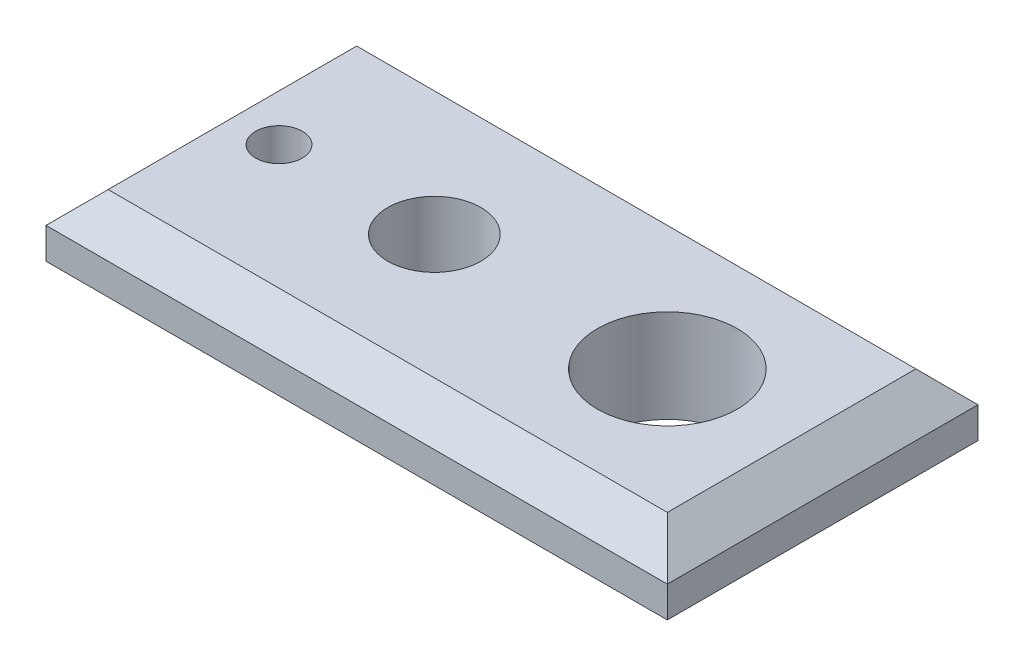
ISO-10303-21;
HEADER;
FILE_DESCRIPTION(('STEP AP214'),'2;1');
FILE_NAME('part.step','',(''),(''),'','','');
FILE_SCHEMA(('AUTOMOTIVE_DESIGN { 1 0 10303 214 1 1 1 1 }'));
ENDSEC;
DATA;
#1=APPLICATION_CONTEXT('core data for automotive mechanical design processes');
#2=APPLICATION_PROTOCOL_DEFINITION('international standard','automotive_design',2000,#1);
#3=PRODUCT_CONTEXT('',#1,'mechanical');
#4=PRODUCT('Part','Part','',(#3));
#5=PRODUCT_RELATED_PRODUCT_CATEGORY('part','',(#4));
#6=PRODUCT_DEFINITION_FORMATION('','',#4);
#7=PRODUCT_DEFINITION_CONTEXT('part definition',#1,'design');
#8=PRODUCT_DEFINITION('design','',#6,#7);
#9=PRODUCT_DEFINITION_SHAPE('','',#8);
#10=(LENGTH_UNIT() NAMED_UNIT(*) SI_UNIT(.MILLI.,.METRE.));
#11=(NAMED_UNIT(*) PLANE_ANGLE_UNIT() SI_UNIT($,.RADIAN.));
#12=(NAMED_UNIT(*) SI_UNIT($,.STERADIAN.) SOLID_ANGLE_UNIT());
#13=UNCERTAINTY_MEASURE_WITH_UNIT(LENGTH_MEASURE(1.E-05),#10,'distance_accuracy_value','');
#14=(GEOMETRIC_REPRESENTATION_CONTEXT(3) GLOBAL_UNCERTAINTY_ASSIGNED_CONTEXT((#13)) GLOBAL_UNIT_ASSIGNED_CONTEXT((#10,
#11,#12)) REPRESENTATION_CONTEXT('',''));
#15=CARTESIAN_POINT('',(0.,0.,0.));
#16=DIRECTION('',(0.,0.,1.));
#17=DIRECTION('',(1.,0.,0.));
#18=AXIS2_PLACEMENT_3D('',#15,#16,#17);
#19=CARTESIAN_POINT('',(0.,30.,0.));
#20=DIRECTION('',(-1.,0.,0.));
#21=DIRECTION('',(0.,0.,1.));
#22=AXIS2_PLACEMENT_3D('',#19,#20,#21);
#23=PLANE('',#22);
#24=DIRECTION('',(0.,-1.,0.));
#25=VECTOR('',#24,1.);
#26=CARTESIAN_POINT('',(0.,30.,0.));
#27=LINE('',#26,#25);
#28=CARTESIAN_POINT('',(0.,20.,0.));
#29=VERTEX_POINT('',#28);
#30=CARTESIAN_POINT('',(0.,10.,0.));
#31=VERTEX_POINT('',#30);
#32=EDGE_CURVE('E166',#29,#31,#27,.T.);
#33=ORIENTED_EDGE('',*,*,#32,.T.);
#34=DIRECTION('',(0.,0.,-1.));
#35=VECTOR('',#34,1.);
#36=CARTESIAN_POINT('',(0.,10.,0.));
#37=LINE('',#36,#35);
#38=CARTESIAN_POINT('',(0.,10.,-100.));
#39=VERTEX_POINT('',#38);
#40=EDGE_CURVE('E180',#31,#39,#37,.T.);
#41=ORIENTED_EDGE('',*,*,#40,.T.);
#42=DIRECTION('',(0.,-1.,0.));
#43=VECTOR('',#42,1.);
#44=CARTESIAN_POINT('',(0.,30.,-100.));
#45=LINE('',#44,#43);
#46=CARTESIAN_POINT('',(0.,20.,-100.));
#47=VERTEX_POINT('',#46);
#48=EDGE_CURVE('E136',#47,#39,#45,.T.);
#49=ORIENTED_EDGE('',*,*,#48,.F.);
#50=DIRECTION('',(0.,0.,1.));
#51=VECTOR('',#50,1.);
#52=CARTESIAN_POINT('',(0.,20.,0.));
#53=LINE('',#52,#51);
#54=EDGE_CURVE('E183',#47,#29,#53,.T.);
#55=ORIENTED_EDGE('',*,*,#54,.T.);
#56=EDGE_LOOP('',(#33,#41,#49,#55));
#57=FACE_BOUND('',#56,.T.);
#58=ADVANCED_FACE('F45',(#57),#23,.F.);
#59=CARTESIAN_POINT('',(0.,30.,-100.));
#60=DIRECTION('',(0.,0.,1.));
#61=DIRECTION('',(1.,0.,0.));
#62=AXIS2_PLACEMENT_3D('',#59,#60,#61);
#63=PLANE('',#62);
#64=ORIENTED_EDGE('',*,*,#48,.T.);
#65=DIRECTION('',(-1.,0.,0.));
#66=VECTOR('',#65,1.);
#67=CARTESIAN_POINT('',(0.,10.,-100.));
#68=LINE('',#67,#66);
#69=CARTESIAN_POINT('',(-200.,10.,-100.));
#70=VERTEX_POINT('',#69);
#71=EDGE_CURVE('E134',#39,#70,#68,.T.);
#72=ORIENTED_EDGE('',*,*,#71,.T.);
#73=DIRECTION('',(0.,-1.,0.));
#74=VECTOR('',#73,1.);
#75=CARTESIAN_POINT('',(-200.,30.,-100.));
#76=LINE('',#75,#74);
#77=CARTESIAN_POINT('',(-200.,20.,-100.));
#78=VERTEX_POINT('',#77);
#79=EDGE_CURVE('E116',#78,#70,#76,.T.);
#80=ORIENTED_EDGE('',*,*,#79,.F.);
#81=DIRECTION('',(1.,0.,0.));
#82=VECTOR('',#81,1.);
#83=CARTESIAN_POINT('',(0.,20.,-100.));
#84=LINE('',#83,#82);
#85=EDGE_CURVE('E131',#78,#47,#84,.T.);
#86=ORIENTED_EDGE('',*,*,#85,.T.);
#87=EDGE_LOOP('',(#64,#72,#80,#86));
#88=FACE_BOUND('',#87,.T.);
#89=ADVANCED_FACE('F130',(#88),#63,.F.);
#90=CARTESIAN_POINT('',(-200.,30.,0.));
#91=DIRECTION('',(1.,0.,0.));
#92=DIRECTION('',(0.,0.,-1.));
#93=AXIS2_PLACEMENT_3D('',#90,#91,#92);
#94=PLANE('',#93);
#95=ORIENTED_EDGE('',*,*,#79,.T.);
#96=DIRECTION('',(0.,0.,1.));
#97=VECTOR('',#96,1.);
#98=CARTESIAN_POINT('',(-200.,10.,0.));
#99=LINE('',#98,#97);
#100=CARTESIAN_POINT('',(-200.,10.,0.));
#101=VERTEX_POINT('',#100);
#102=EDGE_CURVE('E123',#70,#101,#99,.T.);
#103=ORIENTED_EDGE('',*,*,#102,.T.);
#104=DIRECTION('',(0.,-1.,0.));
#105=VECTOR('',#104,1.);
#106=CARTESIAN_POINT('',(-200.,30.,0.));
#107=LINE('',#106,#105);
#108=CARTESIAN_POINT('',(-200.,20.,0.));
#109=VERTEX_POINT('',#108);
#110=EDGE_CURVE('E118',#109,#101,#107,.T.);
#111=ORIENTED_EDGE('',*,*,#110,.F.);
#112=DIRECTION('',(0.,0.,-1.));
#113=VECTOR('',#112,1.);
#114=CARTESIAN_POINT('',(-200.,20.,-100.));
#115=LINE('',#114,#113);
#116=EDGE_CURVE('E113',#109,#78,#115,.T.);
#117=ORIENTED_EDGE('',*,*,#116,.T.);
#118=EDGE_LOOP('',(#95,#103,#111,#117));
#119=FACE_BOUND('',#118,.T.);
#120=ADVANCED_FACE('F115',(#119),#94,.F.);
#121=CARTESIAN_POINT('',(0.,30.,0.));
#122=DIRECTION('',(0.,0.,-1.));
#123=DIRECTION('',(-1.,0.,0.));
#124=AXIS2_PLACEMENT_3D('',#121,#122,#123);
#125=PLANE('',#124);
#126=ORIENTED_EDGE('',*,*,#110,.T.);
#127=DIRECTION('',(1.,0.,0.));
#128=VECTOR('',#127,1.);
#129=CARTESIAN_POINT('',(0.,10.,0.));
#130=LINE('',#129,#128);
#131=EDGE_CURVE('E186',#101,#31,#130,.T.);
#132=ORIENTED_EDGE('',*,*,#131,.T.);
#133=ORIENTED_EDGE('',*,*,#32,.F.);
#134=DIRECTION('',(-1.,0.,0.));
#135=VECTOR('',#134,1.);
#136=CARTESIAN_POINT('',(-200.,20.,0.));
#137=LINE('',#136,#135);
#138=EDGE_CURVE('E189',#29,#109,#137,.T.);
#139=ORIENTED_EDGE('',*,*,#138,.T.);
#140=EDGE_LOOP('',(#126,#132,#133,#139));
#141=FACE_BOUND('',#140,.T.);
#142=ADVANCED_FACE('F252',(#141),#125,.F.);
#143=CARTESIAN_POINT('',(0.,30.,0.));
#144=DIRECTION('',(0.,1.,0.));
#145=DIRECTION('',(0.,0.,1.));
#146=AXIS2_PLACEMENT_3D('',#143,#144,#145);
#147=PLANE('',#146);
#148=CARTESIAN_POINT('',(-175.,30.,-50.));
#149=DIRECTION('',(0.,1.,0.));
#150=DIRECTION('',(0.,0.,1.));
#151=AXIS2_PLACEMENT_3D('',#148,#149,#150);
#152=CIRCLE('',#151,7.50000000000001);
#153=CARTESIAN_POINT('',(-175.,30.,-42.5));
#154=VERTEX_POINT('',#153);
#155=EDGE_CURVE('E231',#154,#154,#152,.T.);
#156=ORIENTED_EDGE('',*,*,#155,.F.);
#157=EDGE_LOOP('',(#156));
#158=FACE_BOUND('',#157,.T.);
#159=CARTESIAN_POINT('',(-125.,30.,-50.));
#160=DIRECTION('',(0.,1.,0.));
#161=DIRECTION('',(0.,0.,1.));
#162=AXIS2_PLACEMENT_3D('',#159,#160,#161);
#163=CIRCLE('',#162,15.);
#164=CARTESIAN_POINT('',(-125.,30.,-35.));
#165=VERTEX_POINT('',#164);
#166=EDGE_CURVE('E227',#165,#165,#163,.T.);
#167=ORIENTED_EDGE('',*,*,#166,.F.);
#168=EDGE_LOOP('',(#167));
#169=FACE_BOUND('',#168,.T.);
#170=CARTESIAN_POINT('',(-50.,30.,-50.));
#171=DIRECTION('',(0.,1.,0.));
#172=DIRECTION('',(0.,0.,1.));
#173=AXIS2_PLACEMENT_3D('',#170,#171,#172);
#174=CIRCLE('',#173,22.5);
#175=CARTESIAN_POINT('',(-50.,30.,-27.5));
#176=VERTEX_POINT('',#175);
#177=EDGE_CURVE('E219',#176,#176,#174,.T.);
#178=ORIENTED_EDGE('',*,*,#177,.F.);
#179=EDGE_LOOP('',(#178));
#180=FACE_BOUND('',#179,.T.);
#181=DIRECTION('',(0.,0.,1.));
#182=VECTOR('',#181,1.);
#183=CARTESIAN_POINT('',(-190.,30.,0.));
#184=LINE('',#183,#182);
#185=CARTESIAN_POINT('',(-190.,30.,-90.));
#186=VERTEX_POINT('',#185);
#187=CARTESIAN_POINT('',(-190.,30.,-9.99999999999999));
#188=VERTEX_POINT('',#187);
#189=EDGE_CURVE('E56',#186,#188,#184,.T.);
#190=ORIENTED_EDGE('',*,*,#189,.T.);
#191=DIRECTION('',(1.,0.,0.));
#192=VECTOR('',#191,1.);
#193=CARTESIAN_POINT('',(0.,30.,-10.));
#194=LINE('',#193,#192);
#195=CARTESIAN_POINT('',(-10.,30.,-10.));
#196=VERTEX_POINT('',#195);
#197=EDGE_CURVE('E11',#188,#196,#194,.T.);
#198=ORIENTED_EDGE('',*,*,#197,.T.);
#199=DIRECTION('',(0.,0.,-1.));
#200=VECTOR('',#199,1.);
#201=CARTESIAN_POINT('',(-10.,30.,-100.));
#202=LINE('',#201,#200);
#203=CARTESIAN_POINT('',(-10.,30.,-90.));
#204=VERTEX_POINT('',#203);
#205=EDGE_CURVE('E177',#196,#204,#202,.T.);
#206=ORIENTED_EDGE('',*,*,#205,.T.);
#207=DIRECTION('',(-1.,0.,0.));
#208=VECTOR('',#207,1.);
#209=CARTESIAN_POINT('',(-200.,30.,-90.));
#210=LINE('',#209,#208);
#211=EDGE_CURVE('E67',#204,#186,#210,.T.);
#212=ORIENTED_EDGE('',*,*,#211,.T.);
#213=EDGE_LOOP('',(#190,#198,#206,#212));
#214=FACE_BOUND('',#213,.T.);
#215=ADVANCED_FACE('F249',(#158,#169,#180,#214),#147,.T.);
#216=CARTESIAN_POINT('',(0.,0.,0.));
#217=DIRECTION('',(0.,1.,0.));
#218=DIRECTION('',(0.,0.,1.));
#219=AXIS2_PLACEMENT_3D('',#216,#217,#218);
#220=PLANE('',#219);
#221=CARTESIAN_POINT('',(-175.,0.,-50.));
#222=DIRECTION('',(0.,1.,0.));
#223=DIRECTION('',(0.,0.,1.));
#224=AXIS2_PLACEMENT_3D('',#221,#222,#223);
#225=CIRCLE('',#224,7.50000000000001);
#226=CARTESIAN_POINT('',(-175.,0.,-42.5));
#227=VERTEX_POINT('',#226);
#228=EDGE_CURVE('E161',#227,#227,#225,.T.);
#229=ORIENTED_EDGE('',*,*,#228,.T.);
#230=EDGE_LOOP('',(#229));
#231=FACE_BOUND('',#230,.T.);
#232=CARTESIAN_POINT('',(-125.,0.,-50.));
#233=DIRECTION('',(0.,1.,0.));
#234=DIRECTION('',(0.,0.,1.));
#235=AXIS2_PLACEMENT_3D('',#232,#233,#234);
#236=CIRCLE('',#235,15.);
#237=CARTESIAN_POINT('',(-125.,0.,-35.));
#238=VERTEX_POINT('',#237);
#239=EDGE_CURVE('E223',#238,#238,#236,.T.);
#240=ORIENTED_EDGE('',*,*,#239,.T.);
#241=EDGE_LOOP('',(#240));
#242=FACE_BOUND('',#241,.T.);
#243=CARTESIAN_POINT('',(-50.,0.,-50.));
#244=DIRECTION('',(0.,1.,0.));
#245=DIRECTION('',(0.,0.,1.));
#246=AXIS2_PLACEMENT_3D('',#243,#244,#245);
#247=CIRCLE('',#246,22.5);
#248=CARTESIAN_POINT('',(-50.,0.,-27.5));
#249=VERTEX_POINT('',#248);
#250=EDGE_CURVE('E215',#249,#249,#247,.T.);
#251=ORIENTED_EDGE('',*,*,#250,.T.);
#252=EDGE_LOOP('',(#251));
#253=FACE_BOUND('',#252,.T.);
#254=DIRECTION('',(0.,0.,-1.));
#255=VECTOR('',#254,1.);
#256=CARTESIAN_POINT('',(-190.,0.,0.));
#257=LINE('',#256,#255);
#258=CARTESIAN_POINT('',(-190.,0.,-10.));
#259=VERTEX_POINT('',#258);
#260=CARTESIAN_POINT('',(-190.,0.,-89.9999999999999));
#261=VERTEX_POINT('',#260);
#262=EDGE_CURVE('E197',#259,#261,#257,.T.);
#263=ORIENTED_EDGE('',*,*,#262,.T.);
#264=DIRECTION('',(1.,0.,0.));
#265=VECTOR('',#264,1.);
#266=CARTESIAN_POINT('',(0.,0.,-90.));
#267=LINE('',#266,#265);
#268=CARTESIAN_POINT('',(-10.,0.,-90.));
#269=VERTEX_POINT('',#268);
#270=EDGE_CURVE('E124',#261,#269,#267,.T.);
#271=ORIENTED_EDGE('',*,*,#270,.T.);
#272=DIRECTION('',(0.,0.,1.));
#273=VECTOR('',#272,1.);
#274=CARTESIAN_POINT('',(-10.,0.,0.));
#275=LINE('',#274,#273);
#276=CARTESIAN_POINT('',(-10.,0.,-10.));
#277=VERTEX_POINT('',#276);
#278=EDGE_CURVE('E203',#269,#277,#275,.T.);
#279=ORIENTED_EDGE('',*,*,#278,.T.);
#280=DIRECTION('',(-1.,0.,0.));
#281=VECTOR('',#280,1.);
#282=CARTESIAN_POINT('',(0.,0.,-10.));
#283=LINE('',#282,#281);
#284=EDGE_CURVE('E200',#277,#259,#283,.T.);
#285=ORIENTED_EDGE('',*,*,#284,.T.);
#286=EDGE_LOOP('',(#263,#271,#279,#285));
#287=FACE_BOUND('',#286,.T.);
#288=ADVANCED_FACE('F239',(#231,#242,#253,#287),#220,.F.);
#289=CARTESIAN_POINT('',(0.,10.,0.));
#290=DIRECTION('',(0.,0.707106781186549,-0.707106781186547));
#291=DIRECTION('',(1.,0.,0.));
#292=AXIS2_PLACEMENT_3D('',#289,#290,#291);
#293=PLANE('',#292);
#294=DIRECTION('',(0.577350269189626,-0.577350269189625,-0.577350269189626));
#295=VECTOR('',#294,1.);
#296=CARTESIAN_POINT('',(-133.333333333333,-56.6666666666666,-66.6666666666668));
#297=LINE('',#296,#295);
#298=EDGE_CURVE('E167',#259,#101,#297,.F.);
#299=ORIENTED_EDGE('',*,*,#298,.F.);
#300=ORIENTED_EDGE('',*,*,#284,.F.);
#301=DIRECTION('',(-0.577350269189626,-0.577350269189625,-0.577350269189626));
#302=VECTOR('',#301,1.);
#303=CARTESIAN_POINT('',(0.,10.,0.));
#304=LINE('',#303,#302);
#305=EDGE_CURVE('E162',#31,#277,#304,.T.);
#306=ORIENTED_EDGE('',*,*,#305,.F.);
#307=ORIENTED_EDGE('',*,*,#131,.F.);
#308=EDGE_LOOP('',(#299,#300,#306,#307));
#309=FACE_BOUND('',#308,.T.);
#310=ADVANCED_FACE('F303',(#309),#293,.F.);
#311=CARTESIAN_POINT('',(0.,10.,0.));
#312=DIRECTION('',(-0.707106781186547,0.707106781186549,0.));
#313=DIRECTION('',(0.,0.,-1.));
#314=AXIS2_PLACEMENT_3D('',#311,#312,#313);
#315=PLANE('',#314);
#316=ORIENTED_EDGE('',*,*,#305,.T.);
#317=ORIENTED_EDGE('',*,*,#278,.F.);
#318=DIRECTION('',(0.577350269189626,0.577350269189625,-0.577350269189626));
#319=VECTOR('',#318,1.);
#320=CARTESIAN_POINT('',(-33.3333333333334,-23.3333333333333,-66.6666666666666));
#321=LINE('',#320,#319);
#322=EDGE_CURVE('E150',#39,#269,#321,.F.);
#323=ORIENTED_EDGE('',*,*,#322,.F.);
#324=ORIENTED_EDGE('',*,*,#40,.F.);
#325=EDGE_LOOP('',(#316,#317,#323,#324));
#326=FACE_BOUND('',#325,.T.);
#327=ADVANCED_FACE('F296',(#326),#315,.F.);
#328=CARTESIAN_POINT('',(-200.,10.,0.));
#329=DIRECTION('',(0.707106781186547,0.707106781186549,0.));
#330=DIRECTION('',(0.,0.,1.));
#331=AXIS2_PLACEMENT_3D('',#328,#329,#330);
#332=PLANE('',#331);
#333=ORIENTED_EDGE('',*,*,#298,.T.);
#334=ORIENTED_EDGE('',*,*,#102,.F.);
#335=DIRECTION('',(0.577350269189626,-0.577350269189625,0.577350269189626));
#336=VECTOR('',#335,1.);
#337=CARTESIAN_POINT('',(-166.666666666667,-23.3333333333333,-66.6666666666666));
#338=LINE('',#337,#336);
#339=EDGE_CURVE('E147',#261,#70,#338,.F.);
#340=ORIENTED_EDGE('',*,*,#339,.F.);
#341=ORIENTED_EDGE('',*,*,#262,.F.);
#342=EDGE_LOOP('',(#333,#334,#340,#341));
#343=FACE_BOUND('',#342,.T.);
#344=ADVANCED_FACE('F289',(#343),#332,.F.);
#345=CARTESIAN_POINT('',(0.,10.,-100.));
#346=DIRECTION('',(0.,0.707106781186549,0.707106781186547));
#347=DIRECTION('',(-1.,0.,0.));
#348=AXIS2_PLACEMENT_3D('',#345,#346,#347);
#349=PLANE('',#348);
#350=ORIENTED_EDGE('',*,*,#322,.T.);
#351=ORIENTED_EDGE('',*,*,#270,.F.);
#352=ORIENTED_EDGE('',*,*,#339,.T.);
#353=ORIENTED_EDGE('',*,*,#71,.F.);
#354=EDGE_LOOP('',(#350,#351,#352,#353));
#355=FACE_BOUND('',#354,.T.);
#356=ADVANCED_FACE('F283',(#355),#349,.F.);
#357=CARTESIAN_POINT('',(0.,30.,-90.));
#358=DIRECTION('',(0.,0.707106781186547,-0.707106781186549));
#359=DIRECTION('',(1.,0.,0.));
#360=AXIS2_PLACEMENT_3D('',#357,#358,#359);
#361=PLANE('',#360);
#362=DIRECTION('',(-0.577350269189625,0.577350269189627,0.577350269189625));
#363=VECTOR('',#362,1.);
#364=CARTESIAN_POINT('',(-40.,60.,-60.0000000000001));
#365=LINE('',#364,#363);
#366=EDGE_CURVE('E141',#47,#204,#365,.T.);
#367=ORIENTED_EDGE('',*,*,#366,.F.);
#368=ORIENTED_EDGE('',*,*,#85,.F.);
#369=DIRECTION('',(0.577350269189625,0.577350269189627,0.577350269189625));
#370=VECTOR('',#369,1.);
#371=CARTESIAN_POINT('',(-126.666666666667,93.3333333333334,-26.6666666666668));
#372=LINE('',#371,#370);
#373=EDGE_CURVE('E50',#186,#78,#372,.F.);
#374=ORIENTED_EDGE('',*,*,#373,.F.);
#375=ORIENTED_EDGE('',*,*,#211,.F.);
#376=EDGE_LOOP('',(#367,#368,#374,#375));
#377=FACE_BOUND('',#376,.T.);
#378=ADVANCED_FACE('F48',(#377),#361,.T.);
#379=CARTESIAN_POINT('',(-190.,30.,0.));
#380=DIRECTION('',(-0.707106781186549,0.707106781186547,0.));
#381=DIRECTION('',(0.,0.,-1.));
#382=AXIS2_PLACEMENT_3D('',#379,#380,#381);
#383=PLANE('',#382);
#384=ORIENTED_EDGE('',*,*,#373,.T.);
#385=ORIENTED_EDGE('',*,*,#116,.F.);
#386=DIRECTION('',(0.577350269189625,0.577350269189627,-0.577350269189625));
#387=VECTOR('',#386,1.);
#388=CARTESIAN_POINT('',(-193.333333333333,26.6666666666667,-6.66666666666666));
#389=LINE('',#388,#387);
#390=EDGE_CURVE('E152',#188,#109,#389,.F.);
#391=ORIENTED_EDGE('',*,*,#390,.F.);
#392=ORIENTED_EDGE('',*,*,#189,.F.);
#393=EDGE_LOOP('',(#384,#385,#391,#392));
#394=FACE_BOUND('',#393,.T.);
#395=ADVANCED_FACE('F145',(#394),#383,.T.);
#396=CARTESIAN_POINT('',(-10.,30.,0.));
#397=DIRECTION('',(0.707106781186549,0.707106781186547,0.));
#398=DIRECTION('',(0.,0.,1.));
#399=AXIS2_PLACEMENT_3D('',#396,#397,#398);
#400=PLANE('',#399);
#401=ORIENTED_EDGE('',*,*,#366,.T.);
#402=ORIENTED_EDGE('',*,*,#205,.F.);
#403=DIRECTION('',(0.577350269189625,-0.577350269189627,0.577350269189625));
#404=VECTOR('',#403,1.);
#405=CARTESIAN_POINT('',(-6.66666666666668,26.6666666666667,-6.66666666666668));
#406=LINE('',#405,#404);
#407=EDGE_CURVE('E156',#29,#196,#406,.F.);
#408=ORIENTED_EDGE('',*,*,#407,.F.);
#409=ORIENTED_EDGE('',*,*,#54,.F.);
#410=EDGE_LOOP('',(#401,#402,#408,#409));
#411=FACE_BOUND('',#410,.T.);
#412=ADVANCED_FACE('F269',(#411),#400,.T.);
#413=CARTESIAN_POINT('',(0.,30.,-10.));
#414=DIRECTION('',(0.,0.707106781186547,0.707106781186549));
#415=DIRECTION('',(-1.,0.,0.));
#416=AXIS2_PLACEMENT_3D('',#413,#414,#415);
#417=PLANE('',#416);
#418=ORIENTED_EDGE('',*,*,#390,.T.);
#419=ORIENTED_EDGE('',*,*,#138,.F.);
#420=ORIENTED_EDGE('',*,*,#407,.T.);
#421=ORIENTED_EDGE('',*,*,#197,.F.);
#422=EDGE_LOOP('',(#418,#419,#420,#421));
#423=FACE_BOUND('',#422,.T.);
#424=ADVANCED_FACE('F260',(#423),#417,.T.);
#425=CARTESIAN_POINT('',(-50.,0.,-50.));
#426=DIRECTION('',(0.,1.,0.));
#427=DIRECTION('',(0.,0.,1.));
#428=AXIS2_PLACEMENT_3D('',#425,#426,#427);
#429=CYLINDRICAL_SURFACE('',#428,22.5);
#430=ORIENTED_EDGE('',*,*,#250,.F.);
#431=EDGE_LOOP('',(#430));
#432=FACE_BOUND('',#431,.T.);
#433=ORIENTED_EDGE('',*,*,#177,.T.);
#434=EDGE_LOOP('',(#433));
#435=FACE_BOUND('',#434,.T.);
#436=ADVANCED_FACE('F258',(#432,#435),#429,.F.);
#437=CARTESIAN_POINT('',(-125.,0.,-50.));
#438=DIRECTION('',(0.,1.,0.));
#439=DIRECTION('',(0.,0.,1.));
#440=AXIS2_PLACEMENT_3D('',#437,#438,#439);
#441=CYLINDRICAL_SURFACE('',#440,15.);
#442=ORIENTED_EDGE('',*,*,#239,.F.);
#443=EDGE_LOOP('',(#442));
#444=FACE_BOUND('',#443,.T.);
#445=ORIENTED_EDGE('',*,*,#166,.T.);
#446=EDGE_LOOP('',(#445));
#447=FACE_BOUND('',#446,.T.);
#448=ADVANCED_FACE('F245',(#444,#447),#441,.F.);
#449=CARTESIAN_POINT('',(-175.,0.,-50.));
#450=DIRECTION('',(0.,1.,0.));
#451=DIRECTION('',(0.,0.,1.));
#452=AXIS2_PLACEMENT_3D('',#449,#450,#451);
#453=CYLINDRICAL_SURFACE('',#452,7.50000000000001);
#454=ORIENTED_EDGE('',*,*,#228,.F.);
#455=EDGE_LOOP('',(#454));
#456=FACE_BOUND('',#455,.T.);
#457=ORIENTED_EDGE('',*,*,#155,.T.);
#458=EDGE_LOOP('',(#457));
#459=FACE_BOUND('',#458,.T.);
#460=ADVANCED_FACE('F242',(#456,#459),#453,.F.);
#461=CLOSED_SHELL('',(#58,#89,#120,#142,#215,#288,#310,#327,#344,#356,#378,#395,#412,#424,#436,
#448,#460));
#462=MANIFOLD_SOLID_BREP('B2',#461);
#463=ADVANCED_BREP_SHAPE_REPRESENTATION('',(#18,#462),#14);
#464=SHAPE_DEFINITION_REPRESENTATION(#9,#463);
ENDSEC;
END-ISO-10303-21;
